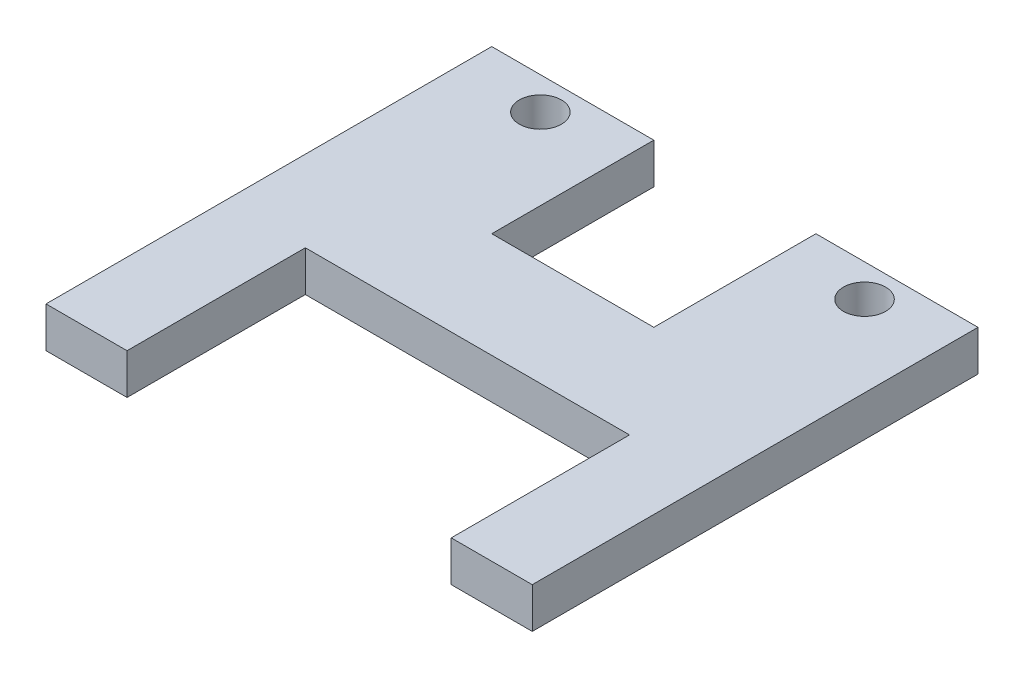
ISO-10303-21;
HEADER;
FILE_DESCRIPTION(('STEP AP214'),'2;1');
FILE_NAME('part.step','',(''),(''),'','','');
FILE_SCHEMA(('AUTOMOTIVE_DESIGN { 1 0 10303 214 1 1 1 1 }'));
ENDSEC;
DATA;
#1=APPLICATION_CONTEXT('core data for automotive mechanical design processes');
#2=APPLICATION_PROTOCOL_DEFINITION('international standard','automotive_design',2000,#1);
#3=PRODUCT_CONTEXT('',#1,'mechanical');
#4=PRODUCT('Part','Part','',(#3));
#5=PRODUCT_RELATED_PRODUCT_CATEGORY('part','',(#4));
#6=PRODUCT_DEFINITION_FORMATION('','',#4);
#7=PRODUCT_DEFINITION_CONTEXT('part definition',#1,'design');
#8=PRODUCT_DEFINITION('design','',#6,#7);
#9=PRODUCT_DEFINITION_SHAPE('','',#8);
#10=(LENGTH_UNIT() NAMED_UNIT(*) SI_UNIT(.MILLI.,.METRE.));
#11=(NAMED_UNIT(*) PLANE_ANGLE_UNIT() SI_UNIT($,.RADIAN.));
#12=(NAMED_UNIT(*) SI_UNIT($,.STERADIAN.) SOLID_ANGLE_UNIT());
#13=UNCERTAINTY_MEASURE_WITH_UNIT(LENGTH_MEASURE(1.E-05),#10,'distance_accuracy_value','');
#14=(GEOMETRIC_REPRESENTATION_CONTEXT(3) GLOBAL_UNCERTAINTY_ASSIGNED_CONTEXT((#13)) GLOBAL_UNIT_ASSIGNED_CONTEXT((#10,
#11,#12)) REPRESENTATION_CONTEXT('',''));
#15=CARTESIAN_POINT('',(0.,0.,0.));
#16=DIRECTION('',(0.,0.,1.));
#17=DIRECTION('',(1.,0.,0.));
#18=AXIS2_PLACEMENT_3D('',#15,#16,#17);
#19=CARTESIAN_POINT('',(-38.1,3.175,-34.925));
#20=DIRECTION('',(0.,0.,1.));
#21=DIRECTION('',(1.,0.,0.));
#22=AXIS2_PLACEMENT_3D('',#19,#20,#21);
#23=PLANE('',#22);
#24=DIRECTION('',(-1.,0.,0.));
#25=VECTOR('',#24,1.);
#26=CARTESIAN_POINT('',(-38.1,3.175,-34.925));
#27=LINE('',#26,#25);
#28=CARTESIAN_POINT('',(-12.7,3.175,-34.925));
#29=VERTEX_POINT('',#28);
#30=CARTESIAN_POINT('',(-38.1,3.175,-34.925));
#31=VERTEX_POINT('',#30);
#32=EDGE_CURVE('E199',#29,#31,#27,.T.);
#33=ORIENTED_EDGE('',*,*,#32,.F.);
#34=DIRECTION('',(0.,1.,0.));
#35=VECTOR('',#34,1.);
#36=CARTESIAN_POINT('',(-12.7,-3.175,-34.925));
#37=LINE('',#36,#35);
#38=CARTESIAN_POINT('',(-12.7,-3.175,-34.925));
#39=VERTEX_POINT('',#38);
#40=EDGE_CURVE('E153',#39,#29,#37,.T.);
#41=ORIENTED_EDGE('',*,*,#40,.F.);
#42=DIRECTION('',(-1.,0.,0.));
#43=VECTOR('',#42,1.);
#44=CARTESIAN_POINT('',(-38.1,-3.175,-34.925));
#45=LINE('',#44,#43);
#46=CARTESIAN_POINT('',(-38.1,-3.175,-34.925));
#47=VERTEX_POINT('',#46);
#48=EDGE_CURVE('E144',#39,#47,#45,.T.);
#49=ORIENTED_EDGE('',*,*,#48,.T.);
#50=DIRECTION('',(0.,-1.,0.));
#51=VECTOR('',#50,1.);
#52=CARTESIAN_POINT('',(-38.1,3.175,-34.925));
#53=LINE('',#52,#51);
#54=EDGE_CURVE('E42',#31,#47,#53,.T.);
#55=ORIENTED_EDGE('',*,*,#54,.F.);
#56=EDGE_LOOP('',(#33,#41,#49,#55));
#57=FACE_BOUND('',#56,.T.);
#58=ADVANCED_FACE('F34',(#57),#23,.F.);
#59=CARTESIAN_POINT('',(-38.1,3.175,34.925));
#60=DIRECTION('',(0.,0.,-1.));
#61=DIRECTION('',(-1.,0.,0.));
#62=AXIS2_PLACEMENT_3D('',#59,#60,#61);
#63=PLANE('',#62);
#64=DIRECTION('',(1.,0.,0.));
#65=VECTOR('',#64,1.);
#66=CARTESIAN_POINT('',(-38.1,-3.175,34.925));
#67=LINE('',#66,#65);
#68=CARTESIAN_POINT('',(-38.1,-3.175,34.925));
#69=VERTEX_POINT('',#68);
#70=CARTESIAN_POINT('',(-25.4,-3.175,34.925));
#71=VERTEX_POINT('',#70);
#72=EDGE_CURVE('E200',#69,#71,#67,.T.);
#73=ORIENTED_EDGE('',*,*,#72,.T.);
#74=DIRECTION('',(0.,1.,0.));
#75=VECTOR('',#74,1.);
#76=CARTESIAN_POINT('',(-25.4,-3.175,34.925));
#77=LINE('',#76,#75);
#78=CARTESIAN_POINT('',(-25.4,3.175,34.925));
#79=VERTEX_POINT('',#78);
#80=EDGE_CURVE('E180',#71,#79,#77,.T.);
#81=ORIENTED_EDGE('',*,*,#80,.T.);
#82=DIRECTION('',(1.,0.,0.));
#83=VECTOR('',#82,1.);
#84=CARTESIAN_POINT('',(-38.1,3.175,34.925));
#85=LINE('',#84,#83);
#86=CARTESIAN_POINT('',(-38.1,3.175,34.925));
#87=VERTEX_POINT('',#86);
#88=EDGE_CURVE('E207',#87,#79,#85,.T.);
#89=ORIENTED_EDGE('',*,*,#88,.F.);
#90=DIRECTION('',(0.,-1.,0.));
#91=VECTOR('',#90,1.);
#92=CARTESIAN_POINT('',(-38.1,3.175,34.925));
#93=LINE('',#92,#91);
#94=EDGE_CURVE('E223',#87,#69,#93,.T.);
#95=ORIENTED_EDGE('',*,*,#94,.T.);
#96=EDGE_LOOP('',(#73,#81,#89,#95));
#97=FACE_BOUND('',#96,.T.);
#98=ADVANCED_FACE('F236',(#97),#63,.F.);
#99=CARTESIAN_POINT('',(38.1,3.175,-34.925));
#100=DIRECTION('',(-1.,0.,0.));
#101=DIRECTION('',(0.,0.,1.));
#102=AXIS2_PLACEMENT_3D('',#99,#100,#101);
#103=PLANE('',#102);
#104=DIRECTION('',(0.,0.,-1.));
#105=VECTOR('',#104,1.);
#106=CARTESIAN_POINT('',(38.1,-3.175,-34.925));
#107=LINE('',#106,#105);
#108=CARTESIAN_POINT('',(38.1,-3.175,34.925));
#109=VERTEX_POINT('',#108);
#110=CARTESIAN_POINT('',(38.1,-3.175,-34.925));
#111=VERTEX_POINT('',#110);
#112=EDGE_CURVE('E189',#109,#111,#107,.T.);
#113=ORIENTED_EDGE('',*,*,#112,.T.);
#114=DIRECTION('',(0.,-1.,0.));
#115=VECTOR('',#114,1.);
#116=CARTESIAN_POINT('',(38.1,3.175,-34.925));
#117=LINE('',#116,#115);
#118=CARTESIAN_POINT('',(38.1,3.175,-34.925));
#119=VERTEX_POINT('',#118);
#120=EDGE_CURVE('E11',#119,#111,#117,.T.);
#121=ORIENTED_EDGE('',*,*,#120,.F.);
#122=DIRECTION('',(0.,0.,-1.));
#123=VECTOR('',#122,1.);
#124=CARTESIAN_POINT('',(38.1,3.175,-34.925));
#125=LINE('',#124,#123);
#126=CARTESIAN_POINT('',(38.1,3.175,34.925));
#127=VERTEX_POINT('',#126);
#128=EDGE_CURVE('E196',#127,#119,#125,.T.);
#129=ORIENTED_EDGE('',*,*,#128,.F.);
#130=DIRECTION('',(0.,-1.,0.));
#131=VECTOR('',#130,1.);
#132=CARTESIAN_POINT('',(38.1,3.175,34.925));
#133=LINE('',#132,#131);
#134=EDGE_CURVE('E210',#127,#109,#133,.T.);
#135=ORIENTED_EDGE('',*,*,#134,.T.);
#136=EDGE_LOOP('',(#113,#121,#129,#135));
#137=FACE_BOUND('',#136,.T.);
#138=ADVANCED_FACE('F36',(#137),#103,.F.);
#139=CARTESIAN_POINT('',(12.7,-3.175,-34.925));
#140=VERTEX_POINT('',#139);
#141=EDGE_CURVE('E213',#111,#140,#45,.T.);
#142=ORIENTED_EDGE('',*,*,#141,.T.);
#143=DIRECTION('',(0.,1.,0.));
#144=VECTOR('',#143,1.);
#145=CARTESIAN_POINT('',(12.7,-3.175,-34.925));
#146=LINE('',#145,#144);
#147=CARTESIAN_POINT('',(12.7,3.175,-34.925));
#148=VERTEX_POINT('',#147);
#149=EDGE_CURVE('E156',#140,#148,#146,.T.);
#150=ORIENTED_EDGE('',*,*,#149,.T.);
#151=EDGE_CURVE('E201',#119,#148,#27,.T.);
#152=ORIENTED_EDGE('',*,*,#151,.F.);
#153=ORIENTED_EDGE('',*,*,#120,.T.);
#154=EDGE_LOOP('',(#142,#150,#152,#153));
#155=FACE_BOUND('',#154,.T.);
#156=ADVANCED_FACE('F244',(#155),#23,.F.);
#157=CARTESIAN_POINT('',(-38.1,3.175,-34.925));
#158=DIRECTION('',(1.,0.,0.));
#159=DIRECTION('',(0.,0.,-1.));
#160=AXIS2_PLACEMENT_3D('',#157,#158,#159);
#161=PLANE('',#160);
#162=DIRECTION('',(0.,0.,1.));
#163=VECTOR('',#162,1.);
#164=CARTESIAN_POINT('',(-38.1,-3.175,-34.925));
#165=LINE('',#164,#163);
#166=EDGE_CURVE('E216',#47,#69,#165,.T.);
#167=ORIENTED_EDGE('',*,*,#166,.T.);
#168=ORIENTED_EDGE('',*,*,#94,.F.);
#169=DIRECTION('',(0.,0.,1.));
#170=VECTOR('',#169,1.);
#171=CARTESIAN_POINT('',(-38.1,3.175,-34.925));
#172=LINE('',#171,#170);
#173=EDGE_CURVE('E204',#31,#87,#172,.T.);
#174=ORIENTED_EDGE('',*,*,#173,.F.);
#175=ORIENTED_EDGE('',*,*,#54,.T.);
#176=EDGE_LOOP('',(#167,#168,#174,#175));
#177=FACE_BOUND('',#176,.T.);
#178=ADVANCED_FACE('F229',(#177),#161,.F.);
#179=CARTESIAN_POINT('',(25.4,3.175,34.925));
#180=VERTEX_POINT('',#179);
#181=EDGE_CURVE('E206',#180,#127,#85,.T.);
#182=ORIENTED_EDGE('',*,*,#181,.F.);
#183=DIRECTION('',(0.,1.,0.));
#184=VECTOR('',#183,1.);
#185=CARTESIAN_POINT('',(25.4,-3.175,34.925));
#186=LINE('',#185,#184);
#187=CARTESIAN_POINT('',(25.4,-3.175,34.925));
#188=VERTEX_POINT('',#187);
#189=EDGE_CURVE('E192',#188,#180,#186,.T.);
#190=ORIENTED_EDGE('',*,*,#189,.F.);
#191=EDGE_CURVE('E218',#188,#109,#67,.T.);
#192=ORIENTED_EDGE('',*,*,#191,.T.);
#193=ORIENTED_EDGE('',*,*,#134,.F.);
#194=EDGE_LOOP('',(#182,#190,#192,#193));
#195=FACE_BOUND('',#194,.T.);
#196=ADVANCED_FACE('F249',(#195),#63,.F.);
#197=CARTESIAN_POINT('',(0.,3.175,0.));
#198=DIRECTION('',(0.,1.,0.));
#199=DIRECTION('',(0.,0.,1.));
#200=AXIS2_PLACEMENT_3D('',#197,#198,#199);
#201=PLANE('',#200);
#202=DIRECTION('',(0.,0.,1.));
#203=VECTOR('',#202,1.);
#204=CARTESIAN_POINT('',(-12.7,3.175,-34.925));
#205=LINE('',#204,#203);
#206=CARTESIAN_POINT('',(-12.7,3.175,-9.525));
#207=VERTEX_POINT('',#206);
#208=EDGE_CURVE('E129',#29,#207,#205,.T.);
#209=ORIENTED_EDGE('',*,*,#208,.F.);
#210=ORIENTED_EDGE('',*,*,#32,.T.);
#211=ORIENTED_EDGE('',*,*,#173,.T.);
#212=ORIENTED_EDGE('',*,*,#88,.T.);
#213=DIRECTION('',(0.,0.,1.));
#214=VECTOR('',#213,1.);
#215=CARTESIAN_POINT('',(-25.4,3.175,34.925));
#216=LINE('',#215,#214);
#217=CARTESIAN_POINT('',(-25.4,3.175,6.98499999999999));
#218=VERTEX_POINT('',#217);
#219=EDGE_CURVE('E169',#218,#79,#216,.T.);
#220=ORIENTED_EDGE('',*,*,#219,.F.);
#221=DIRECTION('',(-1.,0.,0.));
#222=VECTOR('',#221,1.);
#223=CARTESIAN_POINT('',(-25.4,3.175,6.98499999999999));
#224=LINE('',#223,#222);
#225=CARTESIAN_POINT('',(25.4,3.175,6.98499999999999));
#226=VERTEX_POINT('',#225);
#227=EDGE_CURVE('E176',#226,#218,#224,.T.);
#228=ORIENTED_EDGE('',*,*,#227,.F.);
#229=DIRECTION('',(0.,0.,-1.));
#230=VECTOR('',#229,1.);
#231=CARTESIAN_POINT('',(25.4,3.175,34.925));
#232=LINE('',#231,#230);
#233=EDGE_CURVE('E182',#180,#226,#232,.T.);
#234=ORIENTED_EDGE('',*,*,#233,.F.);
#235=ORIENTED_EDGE('',*,*,#181,.T.);
#236=ORIENTED_EDGE('',*,*,#128,.T.);
#237=ORIENTED_EDGE('',*,*,#151,.T.);
#238=DIRECTION('',(0.,0.,-1.));
#239=VECTOR('',#238,1.);
#240=CARTESIAN_POINT('',(12.7,3.175,-34.925));
#241=LINE('',#240,#239);
#242=CARTESIAN_POINT('',(12.7,3.175,-9.525));
#243=VERTEX_POINT('',#242);
#244=EDGE_CURVE('E145',#243,#148,#241,.T.);
#245=ORIENTED_EDGE('',*,*,#244,.F.);
#246=DIRECTION('',(1.,0.,0.));
#247=VECTOR('',#246,1.);
#248=CARTESIAN_POINT('',(-12.7,3.175,-9.525));
#249=LINE('',#248,#247);
#250=EDGE_CURVE('E147',#207,#243,#249,.T.);
#251=ORIENTED_EDGE('',*,*,#250,.F.);
#252=EDGE_LOOP('',(#209,#210,#211,#212,#220,#228,#234,#235,#236,#237,#245,#251));
#253=FACE_BOUND('',#252,.T.);
#254=CARTESIAN_POINT('',(25.4,3.175,-29.845));
#255=DIRECTION('',(0.,1.,0.));
#256=DIRECTION('',(0.,0.,1.));
#257=AXIS2_PLACEMENT_3D('',#254,#255,#256);
#258=CIRCLE('',#257,3.302);
#259=CARTESIAN_POINT('',(25.4,3.175,-26.543));
#260=VERTEX_POINT('',#259);
#261=EDGE_CURVE('E155',#260,#260,#258,.T.);
#262=ORIENTED_EDGE('',*,*,#261,.F.);
#263=EDGE_LOOP('',(#262));
#264=FACE_BOUND('',#263,.T.);
#265=CARTESIAN_POINT('',(-25.4,3.175,-29.845));
#266=DIRECTION('',(0.,1.,0.));
#267=DIRECTION('',(0.,0.,1.));
#268=AXIS2_PLACEMENT_3D('',#265,#266,#267);
#269=CIRCLE('',#268,3.302);
#270=CARTESIAN_POINT('',(-25.4,3.175,-26.543));
#271=VERTEX_POINT('',#270);
#272=EDGE_CURVE('E163',#271,#271,#269,.T.);
#273=ORIENTED_EDGE('',*,*,#272,.F.);
#274=EDGE_LOOP('',(#273));
#275=FACE_BOUND('',#274,.T.);
#276=ADVANCED_FACE('F240',(#253,#264,#275),#201,.T.);
#277=CARTESIAN_POINT('',(0.,-3.175,0.));
#278=DIRECTION('',(0.,1.,0.));
#279=DIRECTION('',(0.,0.,1.));
#280=AXIS2_PLACEMENT_3D('',#277,#278,#279);
#281=PLANE('',#280);
#282=ORIENTED_EDGE('',*,*,#48,.F.);
#283=DIRECTION('',(0.,0.,1.));
#284=VECTOR('',#283,1.);
#285=CARTESIAN_POINT('',(-12.7,-3.175,-34.925));
#286=LINE('',#285,#284);
#287=CARTESIAN_POINT('',(-12.7,-3.175,-9.525));
#288=VERTEX_POINT('',#287);
#289=EDGE_CURVE('E126',#39,#288,#286,.T.);
#290=ORIENTED_EDGE('',*,*,#289,.T.);
#291=DIRECTION('',(1.,0.,0.));
#292=VECTOR('',#291,1.);
#293=CARTESIAN_POINT('',(-12.7,-3.175,-9.525));
#294=LINE('',#293,#292);
#295=CARTESIAN_POINT('',(12.7,-3.175,-9.525));
#296=VERTEX_POINT('',#295);
#297=EDGE_CURVE('E136',#288,#296,#294,.T.);
#298=ORIENTED_EDGE('',*,*,#297,.T.);
#299=DIRECTION('',(0.,0.,-1.));
#300=VECTOR('',#299,1.);
#301=CARTESIAN_POINT('',(12.7,-3.175,-34.925));
#302=LINE('',#301,#300);
#303=EDGE_CURVE('E49',#296,#140,#302,.T.);
#304=ORIENTED_EDGE('',*,*,#303,.T.);
#305=ORIENTED_EDGE('',*,*,#141,.F.);
#306=ORIENTED_EDGE('',*,*,#112,.F.);
#307=ORIENTED_EDGE('',*,*,#191,.F.);
#308=DIRECTION('',(0.,0.,-1.));
#309=VECTOR('',#308,1.);
#310=CARTESIAN_POINT('',(25.4,-3.175,34.925));
#311=LINE('',#310,#309);
#312=CARTESIAN_POINT('',(25.4,-3.175,6.98499999999999));
#313=VERTEX_POINT('',#312);
#314=EDGE_CURVE('E175',#188,#313,#311,.T.);
#315=ORIENTED_EDGE('',*,*,#314,.T.);
#316=DIRECTION('',(-1.,0.,0.));
#317=VECTOR('',#316,1.);
#318=CARTESIAN_POINT('',(-25.4,-3.175,6.98499999999999));
#319=LINE('',#318,#317);
#320=CARTESIAN_POINT('',(-25.4,-3.175,6.98499999999999));
#321=VERTEX_POINT('',#320);
#322=EDGE_CURVE('E57',#313,#321,#319,.T.);
#323=ORIENTED_EDGE('',*,*,#322,.T.);
#324=DIRECTION('',(0.,0.,1.));
#325=VECTOR('',#324,1.);
#326=CARTESIAN_POINT('',(-25.4,-3.175,34.925));
#327=LINE('',#326,#325);
#328=EDGE_CURVE('E172',#321,#71,#327,.T.);
#329=ORIENTED_EDGE('',*,*,#328,.T.);
#330=ORIENTED_EDGE('',*,*,#72,.F.);
#331=ORIENTED_EDGE('',*,*,#166,.F.);
#332=EDGE_LOOP('',(#282,#290,#298,#304,#305,#306,#307,#315,#323,#329,#330,#331));
#333=FACE_BOUND('',#332,.T.);
#334=CARTESIAN_POINT('',(25.4,-3.175,-29.845));
#335=DIRECTION('',(0.,1.,0.));
#336=DIRECTION('',(0.,0.,1.));
#337=AXIS2_PLACEMENT_3D('',#334,#335,#336);
#338=CIRCLE('',#337,3.302);
#339=CARTESIAN_POINT('',(25.4,-3.175,-26.543));
#340=VERTEX_POINT('',#339);
#341=EDGE_CURVE('E160',#340,#340,#338,.T.);
#342=ORIENTED_EDGE('',*,*,#341,.T.);
#343=EDGE_LOOP('',(#342));
#344=FACE_BOUND('',#343,.T.);
#345=CARTESIAN_POINT('',(-25.4,-3.175,-29.845));
#346=DIRECTION('',(0.,1.,0.));
#347=DIRECTION('',(0.,0.,1.));
#348=AXIS2_PLACEMENT_3D('',#345,#346,#347);
#349=CIRCLE('',#348,3.302);
#350=CARTESIAN_POINT('',(-25.4,-3.175,-26.543));
#351=VERTEX_POINT('',#350);
#352=EDGE_CURVE('E166',#351,#351,#349,.T.);
#353=ORIENTED_EDGE('',*,*,#352,.T.);
#354=EDGE_LOOP('',(#353));
#355=FACE_BOUND('',#354,.T.);
#356=ADVANCED_FACE('F141',(#333,#344,#355),#281,.F.);
#357=CARTESIAN_POINT('',(-25.4,-3.175,34.925));
#358=DIRECTION('',(-1.,0.,0.));
#359=DIRECTION('',(0.,0.,1.));
#360=AXIS2_PLACEMENT_3D('',#357,#358,#359);
#361=PLANE('',#360);
#362=ORIENTED_EDGE('',*,*,#219,.T.);
#363=ORIENTED_EDGE('',*,*,#80,.F.);
#364=ORIENTED_EDGE('',*,*,#328,.F.);
#365=DIRECTION('',(0.,1.,0.));
#366=VECTOR('',#365,1.);
#367=CARTESIAN_POINT('',(-25.4,-3.175,6.98499999999999));
#368=LINE('',#367,#366);
#369=EDGE_CURVE('E187',#321,#218,#368,.T.);
#370=ORIENTED_EDGE('',*,*,#369,.T.);
#371=EDGE_LOOP('',(#362,#363,#364,#370));
#372=FACE_BOUND('',#371,.T.);
#373=ADVANCED_FACE('F271',(#372),#361,.F.);
#374=CARTESIAN_POINT('',(-25.4,-3.175,6.98499999999999));
#375=DIRECTION('',(0.,0.,-1.));
#376=DIRECTION('',(-1.,0.,0.));
#377=AXIS2_PLACEMENT_3D('',#374,#375,#376);
#378=PLANE('',#377);
#379=ORIENTED_EDGE('',*,*,#227,.T.);
#380=ORIENTED_EDGE('',*,*,#369,.F.);
#381=ORIENTED_EDGE('',*,*,#322,.F.);
#382=DIRECTION('',(0.,1.,0.));
#383=VECTOR('',#382,1.);
#384=CARTESIAN_POINT('',(25.4,-3.175,6.98499999999999));
#385=LINE('',#384,#383);
#386=EDGE_CURVE('E190',#313,#226,#385,.T.);
#387=ORIENTED_EDGE('',*,*,#386,.T.);
#388=EDGE_LOOP('',(#379,#380,#381,#387));
#389=FACE_BOUND('',#388,.T.);
#390=ADVANCED_FACE('F269',(#389),#378,.F.);
#391=CARTESIAN_POINT('',(25.4,-3.175,34.925));
#392=DIRECTION('',(1.,0.,0.));
#393=DIRECTION('',(0.,0.,-1.));
#394=AXIS2_PLACEMENT_3D('',#391,#392,#393);
#395=PLANE('',#394);
#396=ORIENTED_EDGE('',*,*,#233,.T.);
#397=ORIENTED_EDGE('',*,*,#386,.F.);
#398=ORIENTED_EDGE('',*,*,#314,.F.);
#399=ORIENTED_EDGE('',*,*,#189,.T.);
#400=EDGE_LOOP('',(#396,#397,#398,#399));
#401=FACE_BOUND('',#400,.T.);
#402=ADVANCED_FACE('F268',(#401),#395,.F.);
#403=CARTESIAN_POINT('',(-25.4,-3.175,-29.845));
#404=DIRECTION('',(0.,1.,0.));
#405=DIRECTION('',(0.,0.,1.));
#406=AXIS2_PLACEMENT_3D('',#403,#404,#405);
#407=CYLINDRICAL_SURFACE('',#406,3.302);
#408=ORIENTED_EDGE('',*,*,#352,.F.);
#409=EDGE_LOOP('',(#408));
#410=FACE_BOUND('',#409,.T.);
#411=ORIENTED_EDGE('',*,*,#272,.T.);
#412=EDGE_LOOP('',(#411));
#413=FACE_BOUND('',#412,.T.);
#414=ADVANCED_FACE('F332',(#410,#413),#407,.F.);
#415=CARTESIAN_POINT('',(25.4,-3.175,-29.845));
#416=DIRECTION('',(0.,1.,0.));
#417=DIRECTION('',(0.,0.,1.));
#418=AXIS2_PLACEMENT_3D('',#415,#416,#417);
#419=CYLINDRICAL_SURFACE('',#418,3.302);
#420=ORIENTED_EDGE('',*,*,#341,.F.);
#421=EDGE_LOOP('',(#420));
#422=FACE_BOUND('',#421,.T.);
#423=ORIENTED_EDGE('',*,*,#261,.T.);
#424=EDGE_LOOP('',(#423));
#425=FACE_BOUND('',#424,.T.);
#426=ADVANCED_FACE('F308',(#422,#425),#419,.F.);
#427=CARTESIAN_POINT('',(-12.7,-3.175,-34.925));
#428=DIRECTION('',(-1.,0.,0.));
#429=DIRECTION('',(0.,0.,1.));
#430=AXIS2_PLACEMENT_3D('',#427,#428,#429);
#431=PLANE('',#430);
#432=ORIENTED_EDGE('',*,*,#208,.T.);
#433=DIRECTION('',(0.,1.,0.));
#434=VECTOR('',#433,1.);
#435=CARTESIAN_POINT('',(-12.7,-3.175,-9.525));
#436=LINE('',#435,#434);
#437=EDGE_CURVE('E122',#288,#207,#436,.T.);
#438=ORIENTED_EDGE('',*,*,#437,.F.);
#439=ORIENTED_EDGE('',*,*,#289,.F.);
#440=ORIENTED_EDGE('',*,*,#40,.T.);
#441=EDGE_LOOP('',(#432,#438,#439,#440));
#442=FACE_BOUND('',#441,.T.);
#443=ADVANCED_FACE('F124',(#442),#431,.F.);
#444=CARTESIAN_POINT('',(12.7,-3.175,-34.925));
#445=DIRECTION('',(1.,0.,0.));
#446=DIRECTION('',(0.,0.,-1.));
#447=AXIS2_PLACEMENT_3D('',#444,#445,#446);
#448=PLANE('',#447);
#449=ORIENTED_EDGE('',*,*,#244,.T.);
#450=ORIENTED_EDGE('',*,*,#149,.F.);
#451=ORIENTED_EDGE('',*,*,#303,.F.);
#452=DIRECTION('',(0.,1.,0.));
#453=VECTOR('',#452,1.);
#454=CARTESIAN_POINT('',(12.7,-3.175,-9.525));
#455=LINE('',#454,#453);
#456=EDGE_CURVE('E133',#296,#243,#455,.T.);
#457=ORIENTED_EDGE('',*,*,#456,.T.);
#458=EDGE_LOOP('',(#449,#450,#451,#457));
#459=FACE_BOUND('',#458,.T.);
#460=ADVANCED_FACE('F307',(#459),#448,.F.);
#461=CARTESIAN_POINT('',(-12.7,-3.175,-9.525));
#462=DIRECTION('',(0.,0.,1.));
#463=DIRECTION('',(1.,0.,0.));
#464=AXIS2_PLACEMENT_3D('',#461,#462,#463);
#465=PLANE('',#464);
#466=ORIENTED_EDGE('',*,*,#250,.T.);
#467=ORIENTED_EDGE('',*,*,#456,.F.);
#468=ORIENTED_EDGE('',*,*,#297,.F.);
#469=ORIENTED_EDGE('',*,*,#437,.T.);
#470=EDGE_LOOP('',(#466,#467,#468,#469));
#471=FACE_BOUND('',#470,.T.);
#472=ADVANCED_FACE('F137',(#471),#465,.F.);
#473=CLOSED_SHELL('',(#58,#98,#138,#156,#178,#196,#276,#356,#373,#390,#402,#414,#426,#443,#460,#472));
#474=MANIFOLD_SOLID_BREP('B2',#473);
#475=ADVANCED_BREP_SHAPE_REPRESENTATION('',(#18,#474),#14);
#476=SHAPE_DEFINITION_REPRESENTATION(#9,#475);
ENDSEC;
END-ISO-10303-21;
